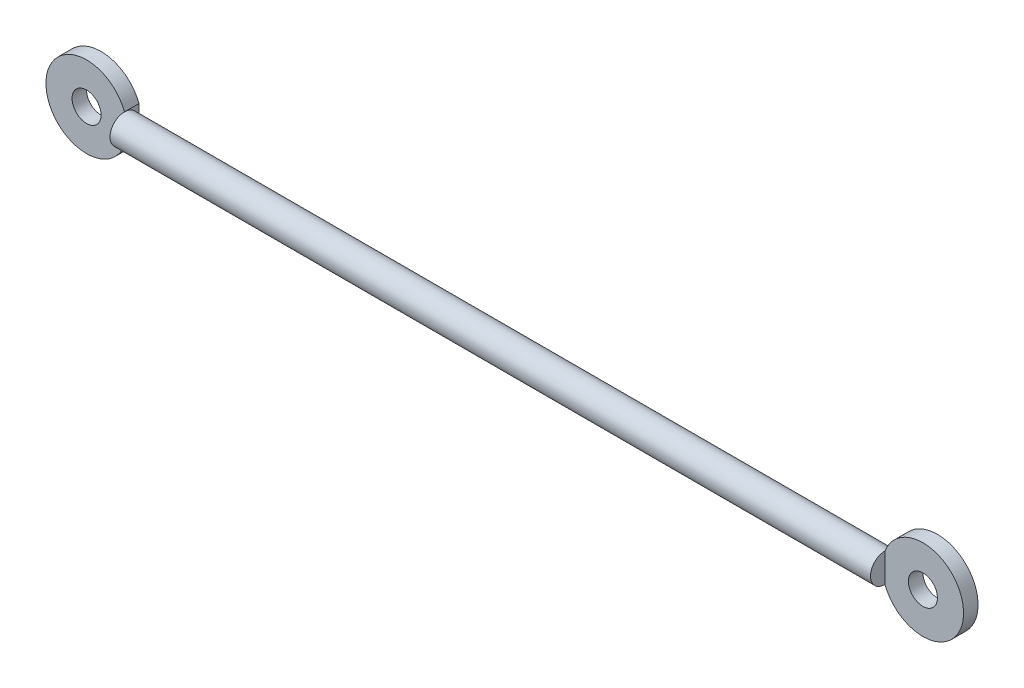
ISO-10303-21;
HEADER;
FILE_DESCRIPTION(('STEP AP214'),'2;1');
FILE_NAME('part.step','',(''),(''),'','','');
FILE_SCHEMA(('AUTOMOTIVE_DESIGN { 1 0 10303 214 1 1 1 1 }'));
ENDSEC;
DATA;
#1=APPLICATION_CONTEXT('core data for automotive mechanical design processes');
#2=APPLICATION_PROTOCOL_DEFINITION('international standard','automotive_design',2000,#1);
#3=PRODUCT_CONTEXT('',#1,'mechanical');
#4=PRODUCT('Part','Part','',(#3));
#5=PRODUCT_RELATED_PRODUCT_CATEGORY('part','',(#4));
#6=PRODUCT_DEFINITION_FORMATION('','',#4);
#7=PRODUCT_DEFINITION_CONTEXT('part definition',#1,'design');
#8=PRODUCT_DEFINITION('design','',#6,#7);
#9=PRODUCT_DEFINITION_SHAPE('','',#8);
#10=(LENGTH_UNIT() NAMED_UNIT(*) SI_UNIT(.MILLI.,.METRE.));
#11=(NAMED_UNIT(*) PLANE_ANGLE_UNIT() SI_UNIT($,.RADIAN.));
#12=(NAMED_UNIT(*) SI_UNIT($,.STERADIAN.) SOLID_ANGLE_UNIT());
#13=UNCERTAINTY_MEASURE_WITH_UNIT(LENGTH_MEASURE(1.E-05),#10,'distance_accuracy_value','');
#14=(GEOMETRIC_REPRESENTATION_CONTEXT(3) GLOBAL_UNCERTAINTY_ASSIGNED_CONTEXT((#13)) GLOBAL_UNIT_ASSIGNED_CONTEXT((#10,
#11,#12)) REPRESENTATION_CONTEXT('',''));
#15=CARTESIAN_POINT('',(0.,0.,0.));
#16=DIRECTION('',(0.,0.,1.));
#17=DIRECTION('',(1.,0.,0.));
#18=AXIS2_PLACEMENT_3D('',#15,#16,#17);
#19=CARTESIAN_POINT('',(65.5,0.,0.));
#20=DIRECTION('',(-1.,0.,0.));
#21=DIRECTION('',(0.,-1.,0.));
#22=AXIS2_PLACEMENT_3D('',#19,#20,#21);
#23=PLANE('',#22);
#24=DIRECTION('',(0.,-1.,0.));
#25=VECTOR('',#24,1.);
#26=CARTESIAN_POINT('',(65.5,2.50000000000002,0.));
#27=LINE('',#26,#25);
#28=CARTESIAN_POINT('',(65.5,2.50000000000002,0.));
#29=VERTEX_POINT('',#28);
#30=CARTESIAN_POINT('',(65.5,-2.49999999999998,0.));
#31=VERTEX_POINT('',#30);
#32=EDGE_CURVE('E209',#29,#31,#27,.T.);
#33=ORIENTED_EDGE('',*,*,#32,.F.);
#34=CARTESIAN_POINT('',(65.5,0.,0.));
#35=DIRECTION('',(-1.,0.,0.));
#36=DIRECTION('',(0.,-1.,0.));
#37=AXIS2_PLACEMENT_3D('',#34,#35,#36);
#38=CIRCLE('',#37,2.5);
#39=EDGE_CURVE('E228',#31,#29,#38,.T.);
#40=ORIENTED_EDGE('',*,*,#39,.F.);
#41=EDGE_LOOP('',(#33,#40));
#42=FACE_BOUND('',#41,.T.);
#43=ADVANCED_FACE('F45',(#42),#23,.F.);
#44=CARTESIAN_POINT('',(-65.5,0.,0.));
#45=DIRECTION('',(-1.,0.,0.));
#46=DIRECTION('',(0.,-1.,0.));
#47=AXIS2_PLACEMENT_3D('',#44,#45,#46);
#48=CYLINDRICAL_SURFACE('',#47,2.5);
#49=ORIENTED_EDGE('',*,*,#39,.T.);
#50=CARTESIAN_POINT('',(65.5,0.,-2.5));
#51=VERTEX_POINT('',#50);
#52=EDGE_CURVE('E69',#29,#51,#38,.T.);
#53=ORIENTED_EDGE('',*,*,#52,.T.);
#54=EDGE_CURVE('E225',#51,#31,#38,.T.);
#55=ORIENTED_EDGE('',*,*,#54,.T.);
#56=EDGE_LOOP('',(#49,#53,#55));
#57=FACE_BOUND('',#56,.T.);
#58=CARTESIAN_POINT('',(-65.5,0.,0.));
#59=DIRECTION('',(-1.,0.,0.));
#60=DIRECTION('',(0.,-1.,0.));
#61=AXIS2_PLACEMENT_3D('',#58,#59,#60);
#62=CIRCLE('',#61,2.5);
#63=CARTESIAN_POINT('',(-65.5,-2.5,0.));
#64=VERTEX_POINT('',#63);
#65=CARTESIAN_POINT('',(-65.5,2.5,0.));
#66=VERTEX_POINT('',#65);
#67=EDGE_CURVE('E11',#64,#66,#62,.T.);
#68=ORIENTED_EDGE('',*,*,#67,.F.);
#69=CARTESIAN_POINT('',(-65.5,0.,-2.5));
#70=VERTEX_POINT('',#69);
#71=EDGE_CURVE('E55',#70,#64,#62,.T.);
#72=ORIENTED_EDGE('',*,*,#71,.F.);
#73=EDGE_CURVE('E54',#66,#70,#62,.T.);
#74=ORIENTED_EDGE('',*,*,#73,.F.);
#75=EDGE_LOOP('',(#68,#72,#74));
#76=FACE_BOUND('',#75,.T.);
#77=ADVANCED_FACE('F47',(#57,#76),#48,.T.);
#78=CARTESIAN_POINT('',(-65.5,-2.5,0.));
#79=DIRECTION('',(1.,0.,0.));
#80=DIRECTION('',(0.,1.,0.));
#81=AXIS2_PLACEMENT_3D('',#78,#79,#80);
#82=PLANE('',#81);
#83=ORIENTED_EDGE('',*,*,#67,.T.);
#84=DIRECTION('',(0.,1.,0.));
#85=VECTOR('',#84,1.);
#86=CARTESIAN_POINT('',(-65.5,-2.5,0.));
#87=LINE('',#86,#85);
#88=EDGE_CURVE('E111',#64,#66,#87,.T.);
#89=ORIENTED_EDGE('',*,*,#88,.F.);
#90=EDGE_LOOP('',(#83,#89));
#91=FACE_BOUND('',#90,.T.);
#92=ADVANCED_FACE('F123',(#91),#82,.F.);
#93=CARTESIAN_POINT('',(65.5,2.50000000000002,-2.5));
#94=DIRECTION('',(-1.,0.,0.));
#95=DIRECTION('',(0.,0.,1.));
#96=AXIS2_PLACEMENT_3D('',#93,#94,#95);
#97=PLANE('',#96);
#98=DIRECTION('',(0.,0.,1.));
#99=VECTOR('',#98,1.);
#100=CARTESIAN_POINT('',(65.5,-2.49999999999998,-2.5));
#101=LINE('',#100,#99);
#102=CARTESIAN_POINT('',(65.5,-2.49999999999998,-2.5));
#103=VERTEX_POINT('',#102);
#104=EDGE_CURVE('E221',#103,#31,#101,.T.);
#105=ORIENTED_EDGE('',*,*,#104,.T.);
#106=ORIENTED_EDGE('',*,*,#54,.F.);
#107=DIRECTION('',(0.,-1.,0.));
#108=VECTOR('',#107,1.);
#109=CARTESIAN_POINT('',(65.5,2.50000000000002,-2.5));
#110=LINE('',#109,#108);
#111=EDGE_CURVE('E208',#51,#103,#110,.T.);
#112=ORIENTED_EDGE('',*,*,#111,.T.);
#113=EDGE_LOOP('',(#105,#106,#112));
#114=FACE_BOUND('',#113,.T.);
#115=ADVANCED_FACE('F125',(#114),#97,.T.);
#116=CARTESIAN_POINT('',(72.038348415311,0.,-2.5));
#117=DIRECTION('',(0.,0.,1.));
#118=DIRECTION('',(1.,0.,0.));
#119=AXIS2_PLACEMENT_3D('',#116,#117,#118);
#120=CYLINDRICAL_SURFACE('',#119,7.);
#121=CARTESIAN_POINT('',(72.038348415311,0.,0.));
#122=DIRECTION('',(0.,0.,1.));
#123=DIRECTION('',(-1.,0.,0.));
#124=AXIS2_PLACEMENT_3D('',#121,#122,#123);
#125=CIRCLE('',#124,7.);
#126=EDGE_CURVE('E200',#31,#29,#125,.T.);
#127=ORIENTED_EDGE('',*,*,#126,.F.);
#128=ORIENTED_EDGE('',*,*,#104,.F.);
#129=CARTESIAN_POINT('',(72.038348415311,0.,-2.5));
#130=DIRECTION('',(0.,0.,1.));
#131=DIRECTION('',(-1.,0.,0.));
#132=AXIS2_PLACEMENT_3D('',#129,#130,#131);
#133=CIRCLE('',#132,7.);
#134=CARTESIAN_POINT('',(65.5,2.50000000000002,-2.5));
#135=VERTEX_POINT('',#134);
#136=EDGE_CURVE('E204',#103,#135,#133,.T.);
#137=ORIENTED_EDGE('',*,*,#136,.T.);
#138=DIRECTION('',(0.,0.,1.));
#139=VECTOR('',#138,1.);
#140=CARTESIAN_POINT('',(65.5,2.50000000000002,-2.5));
#141=LINE('',#140,#139);
#142=EDGE_CURVE('E214',#135,#29,#141,.T.);
#143=ORIENTED_EDGE('',*,*,#142,.T.);
#144=EDGE_LOOP('',(#127,#128,#137,#143));
#145=FACE_BOUND('',#144,.T.);
#146=ADVANCED_FACE('F130',(#145),#120,.T.);
#147=EDGE_CURVE('E210',#135,#51,#110,.T.);
#148=ORIENTED_EDGE('',*,*,#147,.T.);
#149=ORIENTED_EDGE('',*,*,#52,.F.);
#150=ORIENTED_EDGE('',*,*,#142,.F.);
#151=EDGE_LOOP('',(#148,#149,#150));
#152=FACE_BOUND('',#151,.T.);
#153=ADVANCED_FACE('F133',(#152),#97,.T.);
#154=CARTESIAN_POINT('',(72.038348415311,0.,-2.5));
#155=DIRECTION('',(0.,0.,-1.));
#156=DIRECTION('',(-1.,0.,0.));
#157=AXIS2_PLACEMENT_3D('',#154,#155,#156);
#158=PLANE('',#157);
#159=CARTESIAN_POINT('',(72.038348415311,0.,-2.5));
#160=DIRECTION('',(0.,0.,1.));
#161=DIRECTION('',(1.,0.,0.));
#162=AXIS2_PLACEMENT_3D('',#159,#160,#161);
#163=CIRCLE('',#162,2.5);
#164=CARTESIAN_POINT('',(74.538348415311,0.,-2.5));
#165=VERTEX_POINT('',#164);
#166=EDGE_CURVE('E196',#165,#165,#163,.T.);
#167=ORIENTED_EDGE('',*,*,#166,.T.);
#168=EDGE_LOOP('',(#167));
#169=FACE_BOUND('',#168,.T.);
#170=ORIENTED_EDGE('',*,*,#136,.F.);
#171=ORIENTED_EDGE('',*,*,#111,.F.);
#172=ORIENTED_EDGE('',*,*,#147,.F.);
#173=EDGE_LOOP('',(#170,#171,#172));
#174=FACE_BOUND('',#173,.T.);
#175=ADVANCED_FACE('F144',(#169,#174),#158,.T.);
#176=CARTESIAN_POINT('',(72.038348415311,0.,0.));
#177=DIRECTION('',(0.,0.,-1.));
#178=DIRECTION('',(-1.,0.,0.));
#179=AXIS2_PLACEMENT_3D('',#176,#177,#178);
#180=PLANE('',#179);
#181=CARTESIAN_POINT('',(72.038348415311,0.,0.));
#182=DIRECTION('',(0.,0.,1.));
#183=DIRECTION('',(1.,0.,0.));
#184=AXIS2_PLACEMENT_3D('',#181,#182,#183);
#185=CIRCLE('',#184,2.5);
#186=CARTESIAN_POINT('',(74.538348415311,0.,0.));
#187=VERTEX_POINT('',#186);
#188=EDGE_CURVE('E192',#187,#187,#185,.T.);
#189=ORIENTED_EDGE('',*,*,#188,.F.);
#190=EDGE_LOOP('',(#189));
#191=FACE_BOUND('',#190,.T.);
#192=ORIENTED_EDGE('',*,*,#126,.T.);
#193=ORIENTED_EDGE('',*,*,#32,.T.);
#194=EDGE_LOOP('',(#192,#193));
#195=FACE_BOUND('',#194,.T.);
#196=ADVANCED_FACE('F146',(#191,#195),#180,.F.);
#197=CARTESIAN_POINT('',(72.038348415311,0.,-2.5));
#198=DIRECTION('',(0.,0.,1.));
#199=DIRECTION('',(1.,0.,0.));
#200=AXIS2_PLACEMENT_3D('',#197,#198,#199);
#201=CYLINDRICAL_SURFACE('',#200,2.5);
#202=ORIENTED_EDGE('',*,*,#166,.F.);
#203=EDGE_LOOP('',(#202));
#204=FACE_BOUND('',#203,.T.);
#205=ORIENTED_EDGE('',*,*,#188,.T.);
#206=EDGE_LOOP('',(#205));
#207=FACE_BOUND('',#206,.T.);
#208=ADVANCED_FACE('F149',(#204,#207),#201,.F.);
#209=CARTESIAN_POINT('',(-65.5,-2.5,-2.5));
#210=DIRECTION('',(1.,0.,0.));
#211=DIRECTION('',(0.,0.,-1.));
#212=AXIS2_PLACEMENT_3D('',#209,#210,#211);
#213=PLANE('',#212);
#214=DIRECTION('',(0.,1.,0.));
#215=VECTOR('',#214,1.);
#216=CARTESIAN_POINT('',(-65.5,-2.5,-2.5));
#217=LINE('',#216,#215);
#218=CARTESIAN_POINT('',(-65.5,-2.5,-2.5));
#219=VERTEX_POINT('',#218);
#220=EDGE_CURVE('E180',#219,#70,#217,.T.);
#221=ORIENTED_EDGE('',*,*,#220,.T.);
#222=ORIENTED_EDGE('',*,*,#71,.T.);
#223=DIRECTION('',(0.,0.,1.));
#224=VECTOR('',#223,1.);
#225=CARTESIAN_POINT('',(-65.5,-2.5,-2.5));
#226=LINE('',#225,#224);
#227=EDGE_CURVE('E105',#219,#64,#226,.T.);
#228=ORIENTED_EDGE('',*,*,#227,.F.);
#229=EDGE_LOOP('',(#221,#222,#228));
#230=FACE_BOUND('',#229,.T.);
#231=ADVANCED_FACE('F156',(#230),#213,.T.);
#232=CARTESIAN_POINT('',(-72.038348415311,0.,-2.5));
#233=DIRECTION('',(0.,0.,1.));
#234=DIRECTION('',(1.,0.,0.));
#235=AXIS2_PLACEMENT_3D('',#232,#233,#234);
#236=CYLINDRICAL_SURFACE('',#235,7.);
#237=CARTESIAN_POINT('',(-72.038348415311,0.,0.));
#238=DIRECTION('',(0.,0.,1.));
#239=DIRECTION('',(1.,0.,0.));
#240=AXIS2_PLACEMENT_3D('',#237,#238,#239);
#241=CIRCLE('',#240,7.);
#242=EDGE_CURVE('E61',#66,#64,#241,.T.);
#243=ORIENTED_EDGE('',*,*,#242,.F.);
#244=DIRECTION('',(0.,0.,1.));
#245=VECTOR('',#244,1.);
#246=CARTESIAN_POINT('',(-65.5,2.5,-2.5));
#247=LINE('',#246,#245);
#248=CARTESIAN_POINT('',(-65.5,2.5,-2.5));
#249=VERTEX_POINT('',#248);
#250=EDGE_CURVE('E96',#249,#66,#247,.T.);
#251=ORIENTED_EDGE('',*,*,#250,.F.);
#252=CARTESIAN_POINT('',(-72.038348415311,0.,-2.5));
#253=DIRECTION('',(0.,0.,1.));
#254=DIRECTION('',(1.,0.,0.));
#255=AXIS2_PLACEMENT_3D('',#252,#253,#254);
#256=CIRCLE('',#255,7.);
#257=EDGE_CURVE('E118',#249,#219,#256,.T.);
#258=ORIENTED_EDGE('',*,*,#257,.T.);
#259=ORIENTED_EDGE('',*,*,#227,.T.);
#260=EDGE_LOOP('',(#243,#251,#258,#259));
#261=FACE_BOUND('',#260,.T.);
#262=ADVANCED_FACE('F107',(#261),#236,.T.);
#263=ORIENTED_EDGE('',*,*,#250,.T.);
#264=ORIENTED_EDGE('',*,*,#73,.T.);
#265=EDGE_CURVE('E100',#70,#249,#217,.T.);
#266=ORIENTED_EDGE('',*,*,#265,.T.);
#267=EDGE_LOOP('',(#263,#264,#266));
#268=FACE_BOUND('',#267,.T.);
#269=ADVANCED_FACE('F97',(#268),#213,.T.);
#270=CARTESIAN_POINT('',(-72.038348415311,0.,-2.5));
#271=DIRECTION('',(0.,0.,1.));
#272=DIRECTION('',(1.,0.,0.));
#273=AXIS2_PLACEMENT_3D('',#270,#271,#272);
#274=PLANE('',#273);
#275=CARTESIAN_POINT('',(-72.038348415311,0.,-2.5));
#276=DIRECTION('',(0.,0.,1.));
#277=DIRECTION('',(1.,0.,0.));
#278=AXIS2_PLACEMENT_3D('',#275,#276,#277);
#279=CIRCLE('',#278,2.5);
#280=CARTESIAN_POINT('',(-69.538348415311,0.,-2.5));
#281=VERTEX_POINT('',#280);
#282=EDGE_CURVE('E110',#281,#281,#279,.T.);
#283=ORIENTED_EDGE('',*,*,#282,.T.);
#284=EDGE_LOOP('',(#283));
#285=FACE_BOUND('',#284,.T.);
#286=ORIENTED_EDGE('',*,*,#257,.F.);
#287=ORIENTED_EDGE('',*,*,#265,.F.);
#288=ORIENTED_EDGE('',*,*,#220,.F.);
#289=EDGE_LOOP('',(#286,#287,#288));
#290=FACE_BOUND('',#289,.T.);
#291=ADVANCED_FACE('F162',(#285,#290),#274,.F.);
#292=CARTESIAN_POINT('',(-72.038348415311,0.,0.));
#293=DIRECTION('',(0.,0.,1.));
#294=DIRECTION('',(1.,0.,0.));
#295=AXIS2_PLACEMENT_3D('',#292,#293,#294);
#296=PLANE('',#295);
#297=CARTESIAN_POINT('',(-72.038348415311,0.,0.));
#298=DIRECTION('',(0.,0.,1.));
#299=DIRECTION('',(1.,0.,0.));
#300=AXIS2_PLACEMENT_3D('',#297,#298,#299);
#301=CIRCLE('',#300,2.5);
#302=CARTESIAN_POINT('',(-69.538348415311,0.,0.));
#303=VERTEX_POINT('',#302);
#304=EDGE_CURVE('E188',#303,#303,#301,.T.);
#305=ORIENTED_EDGE('',*,*,#304,.F.);
#306=EDGE_LOOP('',(#305));
#307=FACE_BOUND('',#306,.T.);
#308=ORIENTED_EDGE('',*,*,#242,.T.);
#309=ORIENTED_EDGE('',*,*,#88,.T.);
#310=EDGE_LOOP('',(#308,#309));
#311=FACE_BOUND('',#310,.T.);
#312=ADVANCED_FACE('F114',(#307,#311),#296,.T.);
#313=CARTESIAN_POINT('',(-72.038348415311,0.,-2.5));
#314=DIRECTION('',(0.,0.,1.));
#315=DIRECTION('',(1.,0.,0.));
#316=AXIS2_PLACEMENT_3D('',#313,#314,#315);
#317=CYLINDRICAL_SURFACE('',#316,2.5);
#318=ORIENTED_EDGE('',*,*,#282,.F.);
#319=EDGE_LOOP('',(#318));
#320=FACE_BOUND('',#319,.T.);
#321=ORIENTED_EDGE('',*,*,#304,.T.);
#322=EDGE_LOOP('',(#321));
#323=FACE_BOUND('',#322,.T.);
#324=ADVANCED_FACE('F158',(#320,#323),#317,.F.);
#325=CLOSED_SHELL('',(#43,#77,#92,#115,#146,#153,#175,#196,#208,#231,#262,#269,#291,#312,#324));
#326=MANIFOLD_SOLID_BREP('B2',#325);
#327=ADVANCED_BREP_SHAPE_REPRESENTATION('',(#18,#326),#14);
#328=SHAPE_DEFINITION_REPRESENTATION(#9,#327);
ENDSEC;
END-ISO-10303-21;
